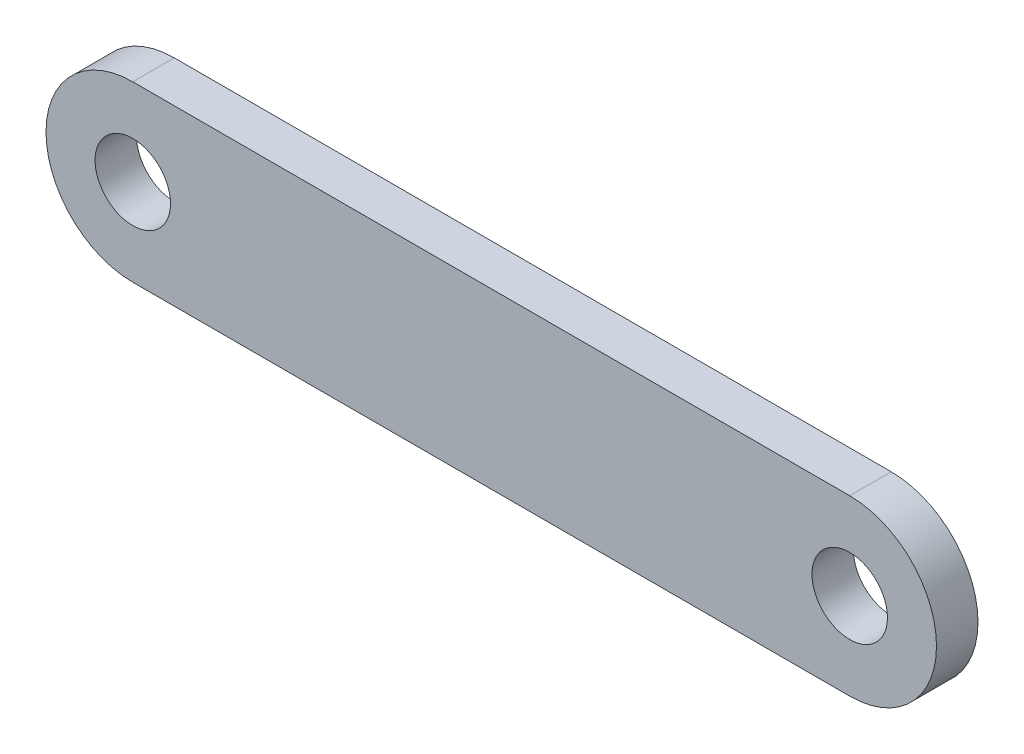
ISO-10303-21;
HEADER;
FILE_DESCRIPTION(('STEP AP214'),'2;1');
FILE_NAME('part.step','',(''),(''),'','','');
FILE_SCHEMA(('AUTOMOTIVE_DESIGN { 1 0 10303 214 1 1 1 1 }'));
ENDSEC;
DATA;
#1=APPLICATION_CONTEXT('core data for automotive mechanical design processes');
#2=APPLICATION_PROTOCOL_DEFINITION('international standard','automotive_design',2000,#1);
#3=PRODUCT_CONTEXT('',#1,'mechanical');
#4=PRODUCT('Part','Part','',(#3));
#5=PRODUCT_RELATED_PRODUCT_CATEGORY('part','',(#4));
#6=PRODUCT_DEFINITION_FORMATION('','',#4);
#7=PRODUCT_DEFINITION_CONTEXT('part definition',#1,'design');
#8=PRODUCT_DEFINITION('design','',#6,#7);
#9=PRODUCT_DEFINITION_SHAPE('','',#8);
#10=(LENGTH_UNIT() NAMED_UNIT(*) SI_UNIT(.MILLI.,.METRE.));
#11=(NAMED_UNIT(*) PLANE_ANGLE_UNIT() SI_UNIT($,.RADIAN.));
#12=(NAMED_UNIT(*) SI_UNIT($,.STERADIAN.) SOLID_ANGLE_UNIT());
#13=UNCERTAINTY_MEASURE_WITH_UNIT(LENGTH_MEASURE(1.E-05),#10,'distance_accuracy_value','');
#14=(GEOMETRIC_REPRESENTATION_CONTEXT(3) GLOBAL_UNCERTAINTY_ASSIGNED_CONTEXT((#13)) GLOBAL_UNIT_ASSIGNED_CONTEXT((#10,
#11,#12)) REPRESENTATION_CONTEXT('',''));
#15=CARTESIAN_POINT('',(0.,0.,0.));
#16=DIRECTION('',(0.,0.,1.));
#17=DIRECTION('',(1.,0.,0.));
#18=AXIS2_PLACEMENT_3D('',#15,#16,#17);
#19=CARTESIAN_POINT('',(-47.5,0.,2.75));
#20=DIRECTION('',(0.,0.,1.));
#21=DIRECTION('',(1.,0.,0.));
#22=AXIS2_PLACEMENT_3D('',#19,#20,#21);
#23=PLANE('',#22);
#24=CARTESIAN_POINT('',(-47.5,0.,2.75));
#25=DIRECTION('',(0.,0.,1.));
#26=DIRECTION('',(1.,0.,0.));
#27=AXIS2_PLACEMENT_3D('',#24,#25,#26);
#28=CIRCLE('',#27,5.);
#29=CARTESIAN_POINT('',(-42.5,0.,2.75));
#30=VERTEX_POINT('',#29);
#31=EDGE_CURVE('E102',#30,#30,#28,.T.);
#32=ORIENTED_EDGE('',*,*,#31,.F.);
#33=EDGE_LOOP('',(#32));
#34=FACE_BOUND('',#33,.T.);
#35=CARTESIAN_POINT('',(-47.5,0.,2.75));
#36=DIRECTION('',(0.,0.,1.));
#37=DIRECTION('',(1.,0.,0.));
#38=AXIS2_PLACEMENT_3D('',#35,#36,#37);
#39=CIRCLE('',#38,11.5);
#40=CARTESIAN_POINT('',(-47.5,11.5,2.75));
#41=VERTEX_POINT('',#40);
#42=CARTESIAN_POINT('',(-47.5,-11.5,2.75));
#43=VERTEX_POINT('',#42);
#44=EDGE_CURVE('E87',#41,#43,#39,.T.);
#45=ORIENTED_EDGE('',*,*,#44,.T.);
#46=DIRECTION('',(1.,0.,0.));
#47=VECTOR('',#46,1.);
#48=CARTESIAN_POINT('',(-47.5,-11.5,2.75));
#49=LINE('',#48,#47);
#50=CARTESIAN_POINT('',(47.5,-11.5,2.75));
#51=VERTEX_POINT('',#50);
#52=EDGE_CURVE('E82',#43,#51,#49,.T.);
#53=ORIENTED_EDGE('',*,*,#52,.T.);
#54=CARTESIAN_POINT('',(47.5,0.,2.75));
#55=DIRECTION('',(0.,0.,1.));
#56=DIRECTION('',(1.,0.,0.));
#57=AXIS2_PLACEMENT_3D('',#54,#55,#56);
#58=CIRCLE('',#57,11.5);
#59=CARTESIAN_POINT('',(47.5,11.5,2.75));
#60=VERTEX_POINT('',#59);
#61=EDGE_CURVE('E85',#51,#60,#58,.T.);
#62=ORIENTED_EDGE('',*,*,#61,.T.);
#63=DIRECTION('',(-1.,0.,0.));
#64=VECTOR('',#63,1.);
#65=CARTESIAN_POINT('',(-47.5,11.5,2.75));
#66=LINE('',#65,#64);
#67=EDGE_CURVE('E52',#60,#41,#66,.T.);
#68=ORIENTED_EDGE('',*,*,#67,.T.);
#69=EDGE_LOOP('',(#45,#53,#62,#68));
#70=FACE_BOUND('',#69,.T.);
#71=CARTESIAN_POINT('',(47.5,0.,2.75));
#72=DIRECTION('',(0.,0.,1.));
#73=DIRECTION('',(1.,0.,0.));
#74=AXIS2_PLACEMENT_3D('',#71,#72,#73);
#75=CIRCLE('',#74,5.);
#76=CARTESIAN_POINT('',(52.5,0.,2.75));
#77=VERTEX_POINT('',#76);
#78=EDGE_CURVE('E117',#77,#77,#75,.T.);
#79=ORIENTED_EDGE('',*,*,#78,.F.);
#80=EDGE_LOOP('',(#79));
#81=FACE_BOUND('',#80,.T.);
#82=ADVANCED_FACE('F35',(#34,#70,#81),#23,.T.);
#83=CARTESIAN_POINT('',(-47.5,0.,-2.75));
#84=DIRECTION('',(0.,0.,1.));
#85=DIRECTION('',(1.,0.,0.));
#86=AXIS2_PLACEMENT_3D('',#83,#84,#85);
#87=PLANE('',#86);
#88=CARTESIAN_POINT('',(-47.5,0.,-2.75));
#89=DIRECTION('',(0.,0.,1.));
#90=DIRECTION('',(1.,0.,0.));
#91=AXIS2_PLACEMENT_3D('',#88,#89,#90);
#92=CIRCLE('',#91,11.5);
#93=CARTESIAN_POINT('',(-47.5,11.5,-2.75));
#94=VERTEX_POINT('',#93);
#95=CARTESIAN_POINT('',(-47.5,-11.5,-2.75));
#96=VERTEX_POINT('',#95);
#97=EDGE_CURVE('E99',#94,#96,#92,.T.);
#98=ORIENTED_EDGE('',*,*,#97,.F.);
#99=DIRECTION('',(-1.,0.,0.));
#100=VECTOR('',#99,1.);
#101=CARTESIAN_POINT('',(-47.5,11.5,-2.75));
#102=LINE('',#101,#100);
#103=CARTESIAN_POINT('',(47.5,11.5,-2.75));
#104=VERTEX_POINT('',#103);
#105=EDGE_CURVE('E75',#104,#94,#102,.T.);
#106=ORIENTED_EDGE('',*,*,#105,.F.);
#107=CARTESIAN_POINT('',(47.5,0.,-2.75));
#108=DIRECTION('',(0.,0.,1.));
#109=DIRECTION('',(1.,0.,0.));
#110=AXIS2_PLACEMENT_3D('',#107,#108,#109);
#111=CIRCLE('',#110,11.5);
#112=CARTESIAN_POINT('',(47.5,-11.5,-2.75));
#113=VERTEX_POINT('',#112);
#114=EDGE_CURVE('E69',#113,#104,#111,.T.);
#115=ORIENTED_EDGE('',*,*,#114,.F.);
#116=DIRECTION('',(1.,0.,0.));
#117=VECTOR('',#116,1.);
#118=CARTESIAN_POINT('',(-47.5,-11.5,-2.75));
#119=LINE('',#118,#117);
#120=EDGE_CURVE('E91',#96,#113,#119,.T.);
#121=ORIENTED_EDGE('',*,*,#120,.F.);
#122=EDGE_LOOP('',(#98,#106,#115,#121));
#123=FACE_BOUND('',#122,.T.);
#124=CARTESIAN_POINT('',(-47.5,0.,-2.75));
#125=DIRECTION('',(0.,0.,1.));
#126=DIRECTION('',(1.,0.,0.));
#127=AXIS2_PLACEMENT_3D('',#124,#125,#126);
#128=CIRCLE('',#127,5.);
#129=CARTESIAN_POINT('',(-42.5,0.,-2.75));
#130=VERTEX_POINT('',#129);
#131=EDGE_CURVE('E114',#130,#130,#128,.T.);
#132=ORIENTED_EDGE('',*,*,#131,.T.);
#133=EDGE_LOOP('',(#132));
#134=FACE_BOUND('',#133,.T.);
#135=CARTESIAN_POINT('',(47.5,0.,-2.75));
#136=DIRECTION('',(0.,0.,1.));
#137=DIRECTION('',(1.,0.,0.));
#138=AXIS2_PLACEMENT_3D('',#135,#136,#137);
#139=CIRCLE('',#138,5.);
#140=CARTESIAN_POINT('',(52.5,0.,-2.75));
#141=VERTEX_POINT('',#140);
#142=EDGE_CURVE('E120',#141,#141,#139,.T.);
#143=ORIENTED_EDGE('',*,*,#142,.T.);
#144=EDGE_LOOP('',(#143));
#145=FACE_BOUND('',#144,.T.);
#146=ADVANCED_FACE('F110',(#123,#134,#145),#87,.F.);
#147=CARTESIAN_POINT('',(-47.5,0.,2.75));
#148=DIRECTION('',(0.,0.,-1.));
#149=DIRECTION('',(-1.,0.,0.));
#150=AXIS2_PLACEMENT_3D('',#147,#148,#149);
#151=CYLINDRICAL_SURFACE('',#150,11.5);
#152=ORIENTED_EDGE('',*,*,#97,.T.);
#153=DIRECTION('',(0.,0.,-1.));
#154=VECTOR('',#153,1.);
#155=CARTESIAN_POINT('',(-47.5,-11.5,2.75));
#156=LINE('',#155,#154);
#157=EDGE_CURVE('E11',#43,#96,#156,.T.);
#158=ORIENTED_EDGE('',*,*,#157,.F.);
#159=ORIENTED_EDGE('',*,*,#44,.F.);
#160=DIRECTION('',(0.,0.,-1.));
#161=VECTOR('',#160,1.);
#162=CARTESIAN_POINT('',(-47.5,11.5,2.75));
#163=LINE('',#162,#161);
#164=EDGE_CURVE('E95',#41,#94,#163,.T.);
#165=ORIENTED_EDGE('',*,*,#164,.T.);
#166=EDGE_LOOP('',(#152,#158,#159,#165));
#167=FACE_BOUND('',#166,.T.);
#168=ADVANCED_FACE('F37',(#167),#151,.T.);
#169=CARTESIAN_POINT('',(-47.5,-11.5,2.75));
#170=DIRECTION('',(0.,1.,0.));
#171=DIRECTION('',(0.,0.,1.));
#172=AXIS2_PLACEMENT_3D('',#169,#170,#171);
#173=PLANE('',#172);
#174=ORIENTED_EDGE('',*,*,#120,.T.);
#175=DIRECTION('',(0.,0.,-1.));
#176=VECTOR('',#175,1.);
#177=CARTESIAN_POINT('',(47.5,-11.5,2.75));
#178=LINE('',#177,#176);
#179=EDGE_CURVE('E44',#51,#113,#178,.T.);
#180=ORIENTED_EDGE('',*,*,#179,.F.);
#181=ORIENTED_EDGE('',*,*,#52,.F.);
#182=ORIENTED_EDGE('',*,*,#157,.T.);
#183=EDGE_LOOP('',(#174,#180,#181,#182));
#184=FACE_BOUND('',#183,.T.);
#185=ADVANCED_FACE('F90',(#184),#173,.F.);
#186=CARTESIAN_POINT('',(47.5,0.,2.75));
#187=DIRECTION('',(0.,0.,-1.));
#188=DIRECTION('',(-1.,0.,0.));
#189=AXIS2_PLACEMENT_3D('',#186,#187,#188);
#190=CYLINDRICAL_SURFACE('',#189,11.5);
#191=ORIENTED_EDGE('',*,*,#114,.T.);
#192=DIRECTION('',(0.,0.,-1.));
#193=VECTOR('',#192,1.);
#194=CARTESIAN_POINT('',(47.5,11.5,2.75));
#195=LINE('',#194,#193);
#196=EDGE_CURVE('E92',#60,#104,#195,.T.);
#197=ORIENTED_EDGE('',*,*,#196,.F.);
#198=ORIENTED_EDGE('',*,*,#61,.F.);
#199=ORIENTED_EDGE('',*,*,#179,.T.);
#200=EDGE_LOOP('',(#191,#197,#198,#199));
#201=FACE_BOUND('',#200,.T.);
#202=ADVANCED_FACE('F93',(#201),#190,.T.);
#203=CARTESIAN_POINT('',(-47.5,11.5,2.75));
#204=DIRECTION('',(0.,-1.,0.));
#205=DIRECTION('',(0.,0.,-1.));
#206=AXIS2_PLACEMENT_3D('',#203,#204,#205);
#207=PLANE('',#206);
#208=ORIENTED_EDGE('',*,*,#105,.T.);
#209=ORIENTED_EDGE('',*,*,#164,.F.);
#210=ORIENTED_EDGE('',*,*,#67,.F.);
#211=ORIENTED_EDGE('',*,*,#196,.T.);
#212=EDGE_LOOP('',(#208,#209,#210,#211));
#213=FACE_BOUND('',#212,.T.);
#214=ADVANCED_FACE('F107',(#213),#207,.F.);
#215=CARTESIAN_POINT('',(-47.5,0.,2.75));
#216=DIRECTION('',(0.,0.,-1.));
#217=DIRECTION('',(-1.,0.,0.));
#218=AXIS2_PLACEMENT_3D('',#215,#216,#217);
#219=CYLINDRICAL_SURFACE('',#218,5.);
#220=ORIENTED_EDGE('',*,*,#31,.T.);
#221=EDGE_LOOP('',(#220));
#222=FACE_BOUND('',#221,.T.);
#223=ORIENTED_EDGE('',*,*,#131,.F.);
#224=EDGE_LOOP('',(#223));
#225=FACE_BOUND('',#224,.T.);
#226=ADVANCED_FACE('F137',(#222,#225),#219,.F.);
#227=CARTESIAN_POINT('',(47.5,0.,2.75));
#228=DIRECTION('',(0.,0.,-1.));
#229=DIRECTION('',(-1.,0.,0.));
#230=AXIS2_PLACEMENT_3D('',#227,#228,#229);
#231=CYLINDRICAL_SURFACE('',#230,5.);
#232=ORIENTED_EDGE('',*,*,#78,.T.);
#233=EDGE_LOOP('',(#232));
#234=FACE_BOUND('',#233,.T.);
#235=ORIENTED_EDGE('',*,*,#142,.F.);
#236=EDGE_LOOP('',(#235));
#237=FACE_BOUND('',#236,.T.);
#238=ADVANCED_FACE('F126',(#234,#237),#231,.F.);
#239=CLOSED_SHELL('',(#82,#146,#168,#185,#202,#214,#226,#238));
#240=MANIFOLD_SOLID_BREP('B2',#239);
#241=ADVANCED_BREP_SHAPE_REPRESENTATION('',(#18,#240),#14);
#242=SHAPE_DEFINITION_REPRESENTATION(#9,#241);
ENDSEC;
END-ISO-10303-21;
